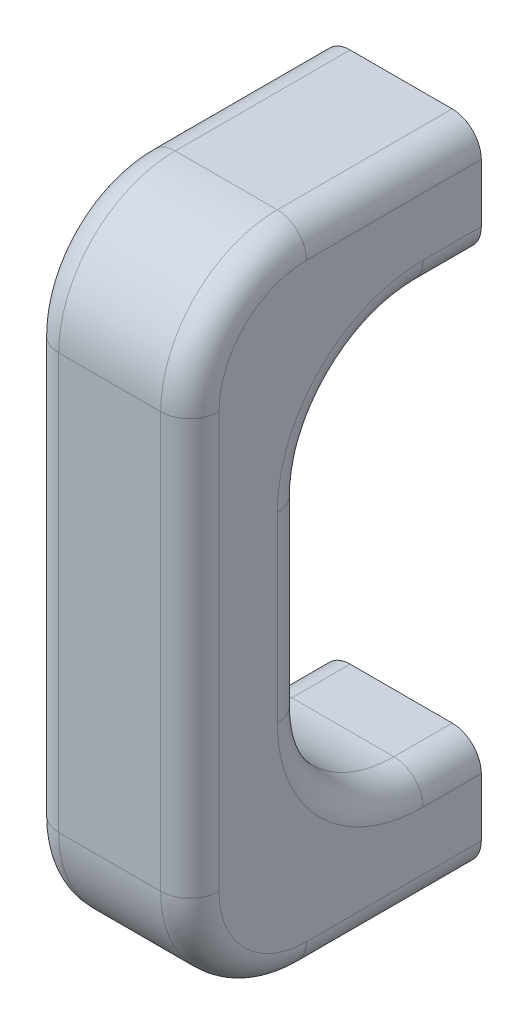
ISO-10303-21;
HEADER;
FILE_DESCRIPTION(('STEP AP214'),'2;1');
FILE_NAME('part.step','',(''),(''),'','','');
FILE_SCHEMA(('AUTOMOTIVE_DESIGN { 1 0 10303 214 1 1 1 1 }'));
ENDSEC;
DATA;
#1=APPLICATION_CONTEXT('core data for automotive mechanical design processes');
#2=APPLICATION_PROTOCOL_DEFINITION('international standard','automotive_design',2000,#1);
#3=PRODUCT_CONTEXT('',#1,'mechanical');
#4=PRODUCT('Part','Part','',(#3));
#5=PRODUCT_RELATED_PRODUCT_CATEGORY('part','',(#4));
#6=PRODUCT_DEFINITION_FORMATION('','',#4);
#7=PRODUCT_DEFINITION_CONTEXT('part definition',#1,'design');
#8=PRODUCT_DEFINITION('design','',#6,#7);
#9=PRODUCT_DEFINITION_SHAPE('','',#8);
#10=(LENGTH_UNIT() NAMED_UNIT(*) SI_UNIT(.MILLI.,.METRE.));
#11=(NAMED_UNIT(*) PLANE_ANGLE_UNIT() SI_UNIT($,.RADIAN.));
#12=(NAMED_UNIT(*) SI_UNIT($,.STERADIAN.) SOLID_ANGLE_UNIT());
#13=UNCERTAINTY_MEASURE_WITH_UNIT(LENGTH_MEASURE(1.E-05),#10,'distance_accuracy_value','');
#14=(GEOMETRIC_REPRESENTATION_CONTEXT(3) GLOBAL_UNCERTAINTY_ASSIGNED_CONTEXT((#13)) GLOBAL_UNIT_ASSIGNED_CONTEXT((#10,
#11,#12)) REPRESENTATION_CONTEXT('',''));
#15=CARTESIAN_POINT('',(0.,0.,0.));
#16=DIRECTION('',(0.,0.,1.));
#17=DIRECTION('',(1.,0.,0.));
#18=AXIS2_PLACEMENT_3D('',#15,#16,#17);
#19=CARTESIAN_POINT('',(0.,0.,0.));
#20=DIRECTION('',(0.,0.,-1.));
#21=DIRECTION('',(-1.,0.,0.));
#22=AXIS2_PLACEMENT_3D('',#19,#20,#21);
#23=PLANE('',#22);
#24=CARTESIAN_POINT('',(0.,-18.2502747095136,0.));
#25=DIRECTION('',(0.,0.,-1.));
#26=DIRECTION('',(-1.,0.,0.));
#27=AXIS2_PLACEMENT_3D('',#24,#25,#26);
#28=CIRCLE('',#27,1.5);
#29=CARTESIAN_POINT('',(-1.5,-18.2502747095136,0.));
#30=VERTEX_POINT('',#29);
#31=EDGE_CURVE('E403',#30,#30,#28,.T.);
#32=ORIENTED_EDGE('',*,*,#31,.F.);
#33=EDGE_LOOP('',(#32));
#34=FACE_BOUND('',#33,.T.);
#35=DIRECTION('',(-1.,0.,0.));
#36=VECTOR('',#35,1.);
#37=CARTESIAN_POINT('',(0.,-14.2505494190273,0.));
#38=LINE('',#37,#36);
#39=CARTESIAN_POINT('',(3.5,-14.2505494190273,0.));
#40=VERTEX_POINT('',#39);
#41=CARTESIAN_POINT('',(-3.5,-14.2505494190273,0.));
#42=VERTEX_POINT('',#41);
#43=EDGE_CURVE('E256',#40,#42,#38,.T.);
#44=ORIENTED_EDGE('',*,*,#43,.F.);
#45=CARTESIAN_POINT('',(3.5,-16.2505494190273,0.));
#46=DIRECTION('',(0.,0.,-1.));
#47=DIRECTION('',(-1.,0.,0.));
#48=AXIS2_PLACEMENT_3D('',#45,#46,#47);
#49=CIRCLE('',#48,2.);
#50=CARTESIAN_POINT('',(5.5,-16.2505494190273,0.));
#51=VERTEX_POINT('',#50);
#52=EDGE_CURVE('E519',#40,#51,#49,.T.);
#53=ORIENTED_EDGE('',*,*,#52,.T.);
#54=DIRECTION('',(0.,1.,0.));
#55=VECTOR('',#54,1.);
#56=CARTESIAN_POINT('',(5.5,-22.25,0.));
#57=LINE('',#56,#55);
#58=CARTESIAN_POINT('',(5.5,-20.25,0.));
#59=VERTEX_POINT('',#58);
#60=EDGE_CURVE('E602',#59,#51,#57,.T.);
#61=ORIENTED_EDGE('',*,*,#60,.F.);
#62=CARTESIAN_POINT('',(3.5,-20.25,0.));
#63=DIRECTION('',(0.,0.,-1.));
#64=DIRECTION('',(-1.,0.,0.));
#65=AXIS2_PLACEMENT_3D('',#62,#63,#64);
#66=CIRCLE('',#65,2.);
#67=CARTESIAN_POINT('',(3.5,-22.25,0.));
#68=VERTEX_POINT('',#67);
#69=EDGE_CURVE('E513',#59,#68,#66,.T.);
#70=ORIENTED_EDGE('',*,*,#69,.T.);
#71=DIRECTION('',(1.,0.,0.));
#72=VECTOR('',#71,1.);
#73=CARTESIAN_POINT('',(-5.5,-22.25,0.));
#74=LINE('',#73,#72);
#75=CARTESIAN_POINT('',(-3.5,-22.25,0.));
#76=VERTEX_POINT('',#75);
#77=EDGE_CURVE('E468',#76,#68,#74,.T.);
#78=ORIENTED_EDGE('',*,*,#77,.F.);
#79=CARTESIAN_POINT('',(-3.5,-20.25,0.));
#80=DIRECTION('',(0.,0.,-1.));
#81=DIRECTION('',(-1.,0.,0.));
#82=AXIS2_PLACEMENT_3D('',#79,#80,#81);
#83=CIRCLE('',#82,2.);
#84=CARTESIAN_POINT('',(-5.5,-20.25,0.));
#85=VERTEX_POINT('',#84);
#86=EDGE_CURVE('E510',#76,#85,#83,.T.);
#87=ORIENTED_EDGE('',*,*,#86,.T.);
#88=DIRECTION('',(0.,-1.,0.));
#89=VECTOR('',#88,1.);
#90=CARTESIAN_POINT('',(-5.5,-22.25,0.));
#91=LINE('',#90,#89);
#92=CARTESIAN_POINT('',(-5.5,-16.2505494190273,0.));
#93=VERTEX_POINT('',#92);
#94=EDGE_CURVE('E469',#93,#85,#91,.T.);
#95=ORIENTED_EDGE('',*,*,#94,.F.);
#96=CARTESIAN_POINT('',(-3.5,-16.2505494190273,0.));
#97=DIRECTION('',(0.,0.,-1.));
#98=DIRECTION('',(-1.,0.,0.));
#99=AXIS2_PLACEMENT_3D('',#96,#97,#98);
#100=CIRCLE('',#99,2.);
#101=EDGE_CURVE('E516',#93,#42,#100,.T.);
#102=ORIENTED_EDGE('',*,*,#101,.T.);
#103=EDGE_LOOP('',(#44,#53,#61,#70,#78,#87,#95,#102));
#104=FACE_BOUND('',#103,.T.);
#105=ADVANCED_FACE('F38',(#34,#104),#23,.T.);
#106=CARTESIAN_POINT('',(5.5,-22.25,20.));
#107=DIRECTION('',(-1.,0.,0.));
#108=DIRECTION('',(0.,0.,1.));
#109=AXIS2_PLACEMENT_3D('',#106,#107,#108);
#110=PLANE('',#109);
#111=ORIENTED_EDGE('',*,*,#60,.T.);
#112=DIRECTION('',(0.,0.,-1.));
#113=VECTOR('',#112,1.);
#114=CARTESIAN_POINT('',(5.5,-16.2505494190273,20.));
#115=LINE('',#114,#113);
#116=CARTESIAN_POINT('',(5.5,-16.2505494190273,3.99985580356592));
#117=VERTEX_POINT('',#116);
#118=EDGE_CURVE('E291',#51,#117,#115,.F.);
#119=ORIENTED_EDGE('',*,*,#118,.T.);
#120=CARTESIAN_POINT('',(5.5,-6.25054941902726,3.99985580356592));
#121=DIRECTION('',(-1.,0.,0.));
#122=DIRECTION('',(0.,0.,1.));
#123=AXIS2_PLACEMENT_3D('',#120,#121,#122);
#124=CIRCLE('',#123,10.);
#125=CARTESIAN_POINT('',(5.5,-6.25054941902726,13.9998558035659));
#126=VERTEX_POINT('',#125);
#127=EDGE_CURVE('E298',#117,#126,#124,.T.);
#128=ORIENTED_EDGE('',*,*,#127,.T.);
#129=DIRECTION('',(0.,-1.,0.));
#130=VECTOR('',#129,1.);
#131=CARTESIAN_POINT('',(5.5,-22.25,13.9998558035659));
#132=LINE('',#131,#130);
#133=CARTESIAN_POINT('',(5.5,6.25054941902726,13.9998558035659));
#134=VERTEX_POINT('',#133);
#135=EDGE_CURVE('E542',#126,#134,#132,.F.);
#136=ORIENTED_EDGE('',*,*,#135,.T.);
#137=CARTESIAN_POINT('',(5.5,6.25054941902726,3.99985580356592));
#138=DIRECTION('',(-1.,0.,0.));
#139=DIRECTION('',(0.,0.,1.));
#140=AXIS2_PLACEMENT_3D('',#137,#138,#139);
#141=CIRCLE('',#140,10.);
#142=CARTESIAN_POINT('',(5.5,16.2505494190273,3.99985580356592));
#143=VERTEX_POINT('',#142);
#144=EDGE_CURVE('E536',#134,#143,#141,.T.);
#145=ORIENTED_EDGE('',*,*,#144,.T.);
#146=DIRECTION('',(0.,0.,1.));
#147=VECTOR('',#146,1.);
#148=CARTESIAN_POINT('',(5.5,16.2505494190273,20.));
#149=LINE('',#148,#147);
#150=CARTESIAN_POINT('',(5.5,16.2505494190273,0.));
#151=VERTEX_POINT('',#150);
#152=EDGE_CURVE('E539',#143,#151,#149,.F.);
#153=ORIENTED_EDGE('',*,*,#152,.T.);
#154=CARTESIAN_POINT('',(5.5,20.25,0.));
#155=VERTEX_POINT('',#154);
#156=EDGE_CURVE('E604',#151,#155,#57,.T.);
#157=ORIENTED_EDGE('',*,*,#156,.T.);
#158=DIRECTION('',(0.,0.,-1.));
#159=VECTOR('',#158,1.);
#160=CARTESIAN_POINT('',(5.5,20.25,20.));
#161=LINE('',#160,#159);
#162=CARTESIAN_POINT('',(5.5,20.25,12.));
#163=VERTEX_POINT('',#162);
#164=EDGE_CURVE('E533',#155,#163,#161,.F.);
#165=ORIENTED_EDGE('',*,*,#164,.T.);
#166=CARTESIAN_POINT('',(5.5,14.25,12.));
#167=DIRECTION('',(-1.,0.,0.));
#168=DIRECTION('',(0.,0.,1.));
#169=AXIS2_PLACEMENT_3D('',#166,#167,#168);
#170=CIRCLE('',#169,6.);
#171=CARTESIAN_POINT('',(5.5,14.25,18.));
#172=VERTEX_POINT('',#171);
#173=EDGE_CURVE('E522',#163,#172,#170,.F.);
#174=ORIENTED_EDGE('',*,*,#173,.T.);
#175=DIRECTION('',(0.,1.,0.));
#176=VECTOR('',#175,1.);
#177=CARTESIAN_POINT('',(5.5,-22.25,18.));
#178=LINE('',#177,#176);
#179=CARTESIAN_POINT('',(5.5,-14.25,18.));
#180=VERTEX_POINT('',#179);
#181=EDGE_CURVE('E524',#172,#180,#178,.F.);
#182=ORIENTED_EDGE('',*,*,#181,.T.);
#183=CARTESIAN_POINT('',(5.5,-14.25,12.));
#184=DIRECTION('',(-1.,0.,0.));
#185=DIRECTION('',(0.,0.,1.));
#186=AXIS2_PLACEMENT_3D('',#183,#184,#185);
#187=CIRCLE('',#186,6.);
#188=CARTESIAN_POINT('',(5.5,-20.25,12.));
#189=VERTEX_POINT('',#188);
#190=EDGE_CURVE('E527',#180,#189,#187,.F.);
#191=ORIENTED_EDGE('',*,*,#190,.T.);
#192=DIRECTION('',(0.,0.,-1.));
#193=VECTOR('',#192,1.);
#194=CARTESIAN_POINT('',(5.5,-20.25,20.));
#195=LINE('',#194,#193);
#196=EDGE_CURVE('E530',#189,#59,#195,.T.);
#197=ORIENTED_EDGE('',*,*,#196,.T.);
#198=EDGE_LOOP('',(#111,#119,#128,#136,#145,#153,#157,#165,#174,#182,#191,#197));
#199=FACE_BOUND('',#198,.T.);
#200=ADVANCED_FACE('F549',(#199),#110,.F.);
#201=CARTESIAN_POINT('',(-5.5,22.25,20.));
#202=DIRECTION('',(0.,-1.,0.));
#203=DIRECTION('',(0.,0.,-1.));
#204=AXIS2_PLACEMENT_3D('',#201,#202,#203);
#205=PLANE('',#204);
#206=DIRECTION('',(-1.,0.,0.));
#207=VECTOR('',#206,1.);
#208=CARTESIAN_POINT('',(-5.5,22.25,12.));
#209=LINE('',#208,#207);
#210=CARTESIAN_POINT('',(-3.5,22.25,12.));
#211=VERTEX_POINT('',#210);
#212=CARTESIAN_POINT('',(3.5,22.25,12.));
#213=VERTEX_POINT('',#212);
#214=EDGE_CURVE('E490',#211,#213,#209,.F.);
#215=ORIENTED_EDGE('',*,*,#214,.T.);
#216=DIRECTION('',(0.,0.,-1.));
#217=VECTOR('',#216,1.);
#218=CARTESIAN_POINT('',(3.5,22.25,20.));
#219=LINE('',#218,#217);
#220=CARTESIAN_POINT('',(3.5,22.25,0.));
#221=VERTEX_POINT('',#220);
#222=EDGE_CURVE('E358',#213,#221,#219,.T.);
#223=ORIENTED_EDGE('',*,*,#222,.T.);
#224=DIRECTION('',(-1.,0.,0.));
#225=VECTOR('',#224,1.);
#226=CARTESIAN_POINT('',(-5.5,22.25,0.));
#227=LINE('',#226,#225);
#228=CARTESIAN_POINT('',(-3.5,22.25,0.));
#229=VERTEX_POINT('',#228);
#230=EDGE_CURVE('E477',#221,#229,#227,.T.);
#231=ORIENTED_EDGE('',*,*,#230,.T.);
#232=DIRECTION('',(0.,0.,-1.));
#233=VECTOR('',#232,1.);
#234=CARTESIAN_POINT('',(-3.5,22.25,20.));
#235=LINE('',#234,#233);
#236=EDGE_CURVE('E355',#229,#211,#235,.F.);
#237=ORIENTED_EDGE('',*,*,#236,.T.);
#238=EDGE_LOOP('',(#215,#223,#231,#237));
#239=FACE_BOUND('',#238,.T.);
#240=ADVANCED_FACE('F600',(#239),#205,.F.);
#241=CARTESIAN_POINT('',(-5.5,-22.25,20.));
#242=DIRECTION('',(1.,0.,0.));
#243=DIRECTION('',(0.,0.,-1.));
#244=AXIS2_PLACEMENT_3D('',#241,#242,#243);
#245=PLANE('',#244);
#246=CARTESIAN_POINT('',(-5.5,20.25,0.));
#247=VERTEX_POINT('',#246);
#248=CARTESIAN_POINT('',(-5.5,16.2505494190273,0.));
#249=VERTEX_POINT('',#248);
#250=EDGE_CURVE('E458',#247,#249,#91,.T.);
#251=ORIENTED_EDGE('',*,*,#250,.T.);
#252=DIRECTION('',(0.,0.,1.));
#253=VECTOR('',#252,1.);
#254=CARTESIAN_POINT('',(-5.5,16.2505494190273,20.));
#255=LINE('',#254,#253);
#256=CARTESIAN_POINT('',(-5.5,16.2505494190273,3.99985580356592));
#257=VERTEX_POINT('',#256);
#258=EDGE_CURVE('E351',#249,#257,#255,.T.);
#259=ORIENTED_EDGE('',*,*,#258,.T.);
#260=CARTESIAN_POINT('',(-5.5,6.25054941902726,3.99985580356592));
#261=DIRECTION('',(1.,0.,0.));
#262=DIRECTION('',(0.,0.,-1.));
#263=AXIS2_PLACEMENT_3D('',#260,#261,#262);
#264=CIRCLE('',#263,10.);
#265=CARTESIAN_POINT('',(-5.5,6.25054941902726,13.9998558035659));
#266=VERTEX_POINT('',#265);
#267=EDGE_CURVE('E340',#257,#266,#264,.T.);
#268=ORIENTED_EDGE('',*,*,#267,.T.);
#269=DIRECTION('',(0.,-1.,0.));
#270=VECTOR('',#269,1.);
#271=CARTESIAN_POINT('',(-5.5,-22.25,13.9998558035659));
#272=LINE('',#271,#270);
#273=CARTESIAN_POINT('',(-5.5,-6.25054941902726,13.9998558035659));
#274=VERTEX_POINT('',#273);
#275=EDGE_CURVE('E343',#266,#274,#272,.T.);
#276=ORIENTED_EDGE('',*,*,#275,.T.);
#277=CARTESIAN_POINT('',(-5.5,-6.25054941902726,3.99985580356592));
#278=DIRECTION('',(1.,0.,0.));
#279=DIRECTION('',(0.,0.,-1.));
#280=AXIS2_PLACEMENT_3D('',#277,#278,#279);
#281=CIRCLE('',#280,10.);
#282=CARTESIAN_POINT('',(-5.5,-16.2505494190273,3.99985580356592));
#283=VERTEX_POINT('',#282);
#284=EDGE_CURVE('E346',#274,#283,#281,.T.);
#285=ORIENTED_EDGE('',*,*,#284,.T.);
#286=DIRECTION('',(0.,0.,-1.));
#287=VECTOR('',#286,1.);
#288=CARTESIAN_POINT('',(-5.5,-16.2505494190273,20.));
#289=LINE('',#288,#287);
#290=EDGE_CURVE('E279',#283,#93,#289,.T.);
#291=ORIENTED_EDGE('',*,*,#290,.T.);
#292=ORIENTED_EDGE('',*,*,#94,.T.);
#293=DIRECTION('',(0.,0.,-1.));
#294=VECTOR('',#293,1.);
#295=CARTESIAN_POINT('',(-5.5,-20.25,20.));
#296=LINE('',#295,#294);
#297=CARTESIAN_POINT('',(-5.5,-20.25,12.));
#298=VERTEX_POINT('',#297);
#299=EDGE_CURVE('E337',#85,#298,#296,.F.);
#300=ORIENTED_EDGE('',*,*,#299,.T.);
#301=CARTESIAN_POINT('',(-5.5,-14.25,12.));
#302=DIRECTION('',(1.,0.,0.));
#303=DIRECTION('',(0.,0.,-1.));
#304=AXIS2_PLACEMENT_3D('',#301,#302,#303);
#305=CIRCLE('',#304,6.);
#306=CARTESIAN_POINT('',(-5.5,-14.25,18.));
#307=VERTEX_POINT('',#306);
#308=EDGE_CURVE('E334',#298,#307,#305,.F.);
#309=ORIENTED_EDGE('',*,*,#308,.T.);
#310=DIRECTION('',(0.,-1.,0.));
#311=VECTOR('',#310,1.);
#312=CARTESIAN_POINT('',(-5.5,-22.25,18.));
#313=LINE('',#312,#311);
#314=CARTESIAN_POINT('',(-5.5,14.25,18.));
#315=VERTEX_POINT('',#314);
#316=EDGE_CURVE('E331',#307,#315,#313,.F.);
#317=ORIENTED_EDGE('',*,*,#316,.T.);
#318=CARTESIAN_POINT('',(-5.5,14.25,12.));
#319=DIRECTION('',(1.,0.,0.));
#320=DIRECTION('',(0.,0.,-1.));
#321=AXIS2_PLACEMENT_3D('',#318,#319,#320);
#322=CIRCLE('',#321,6.);
#323=CARTESIAN_POINT('',(-5.5,20.25,12.));
#324=VERTEX_POINT('',#323);
#325=EDGE_CURVE('E325',#315,#324,#322,.F.);
#326=ORIENTED_EDGE('',*,*,#325,.T.);
#327=DIRECTION('',(0.,0.,-1.));
#328=VECTOR('',#327,1.);
#329=CARTESIAN_POINT('',(-5.5,20.25,20.));
#330=LINE('',#329,#328);
#331=EDGE_CURVE('E328',#324,#247,#330,.T.);
#332=ORIENTED_EDGE('',*,*,#331,.T.);
#333=EDGE_LOOP('',(#251,#259,#268,#276,#285,#291,#292,#300,#309,#317,#326,#332));
#334=FACE_BOUND('',#333,.T.);
#335=ADVANCED_FACE('F457',(#334),#245,.F.);
#336=CARTESIAN_POINT('',(-5.5,-22.25,20.));
#337=DIRECTION('',(0.,1.,0.));
#338=DIRECTION('',(0.,0.,1.));
#339=AXIS2_PLACEMENT_3D('',#336,#337,#338);
#340=PLANE('',#339);
#341=ORIENTED_EDGE('',*,*,#77,.T.);
#342=DIRECTION('',(0.,0.,-1.));
#343=VECTOR('',#342,1.);
#344=CARTESIAN_POINT('',(3.5,-22.25,20.));
#345=LINE('',#344,#343);
#346=CARTESIAN_POINT('',(3.5,-22.25,12.));
#347=VERTEX_POINT('',#346);
#348=EDGE_CURVE('E366',#68,#347,#345,.F.);
#349=ORIENTED_EDGE('',*,*,#348,.T.);
#350=DIRECTION('',(1.,0.,0.));
#351=VECTOR('',#350,1.);
#352=CARTESIAN_POINT('',(-5.5,-22.25,12.));
#353=LINE('',#352,#351);
#354=CARTESIAN_POINT('',(-3.5,-22.25,12.));
#355=VERTEX_POINT('',#354);
#356=EDGE_CURVE('E486',#347,#355,#353,.F.);
#357=ORIENTED_EDGE('',*,*,#356,.T.);
#358=DIRECTION('',(0.,0.,-1.));
#359=VECTOR('',#358,1.);
#360=CARTESIAN_POINT('',(-3.5,-22.25,20.));
#361=LINE('',#360,#359);
#362=EDGE_CURVE('E362',#355,#76,#361,.T.);
#363=ORIENTED_EDGE('',*,*,#362,.T.);
#364=EDGE_LOOP('',(#341,#349,#357,#363));
#365=FACE_BOUND('',#364,.T.);
#366=ADVANCED_FACE('F639',(#365),#340,.F.);
#367=CARTESIAN_POINT('',(0.,0.,20.));
#368=DIRECTION('',(0.,0.,-1.));
#369=DIRECTION('',(-1.,0.,0.));
#370=AXIS2_PLACEMENT_3D('',#367,#368,#369);
#371=PLANE('',#370);
#372=DIRECTION('',(1.,0.,0.));
#373=VECTOR('',#372,1.);
#374=CARTESIAN_POINT('',(0.,-14.25,20.));
#375=LINE('',#374,#373);
#376=CARTESIAN_POINT('',(-3.5,-14.25,20.));
#377=VERTEX_POINT('',#376);
#378=CARTESIAN_POINT('',(3.5,-14.25,20.));
#379=VERTEX_POINT('',#378);
#380=EDGE_CURVE('E483',#377,#379,#375,.T.);
#381=ORIENTED_EDGE('',*,*,#380,.T.);
#382=DIRECTION('',(0.,1.,0.));
#383=VECTOR('',#382,1.);
#384=CARTESIAN_POINT('',(3.5,0.,20.));
#385=LINE('',#384,#383);
#386=CARTESIAN_POINT('',(3.5,14.25,20.));
#387=VERTEX_POINT('',#386);
#388=EDGE_CURVE('E67',#379,#387,#385,.T.);
#389=ORIENTED_EDGE('',*,*,#388,.T.);
#390=DIRECTION('',(-1.,0.,0.));
#391=VECTOR('',#390,1.);
#392=CARTESIAN_POINT('',(0.,14.25,20.));
#393=LINE('',#392,#391);
#394=CARTESIAN_POINT('',(-3.5,14.25,20.));
#395=VERTEX_POINT('',#394);
#396=EDGE_CURVE('E473',#387,#395,#393,.T.);
#397=ORIENTED_EDGE('',*,*,#396,.T.);
#398=DIRECTION('',(0.,-1.,0.));
#399=VECTOR('',#398,1.);
#400=CARTESIAN_POINT('',(-3.5,0.,20.));
#401=LINE('',#400,#399);
#402=EDGE_CURVE('E375',#395,#377,#401,.T.);
#403=ORIENTED_EDGE('',*,*,#402,.T.);
#404=EDGE_LOOP('',(#381,#389,#397,#403));
#405=FACE_BOUND('',#404,.T.);
#406=ADVANCED_FACE('F578',(#405),#371,.F.);
#407=CARTESIAN_POINT('',(0.,18.2502747095136,0.));
#408=DIRECTION('',(0.,0.,-1.));
#409=DIRECTION('',(-1.,0.,0.));
#410=AXIS2_PLACEMENT_3D('',#407,#408,#409);
#411=CIRCLE('',#410,1.5);
#412=CARTESIAN_POINT('',(-1.5,18.2502747095136,0.));
#413=VERTEX_POINT('',#412);
#414=EDGE_CURVE('E615',#413,#413,#411,.T.);
#415=ORIENTED_EDGE('',*,*,#414,.F.);
#416=EDGE_LOOP('',(#415));
#417=FACE_BOUND('',#416,.T.);
#418=ORIENTED_EDGE('',*,*,#156,.F.);
#419=CARTESIAN_POINT('',(3.5,16.2505494190273,0.));
#420=DIRECTION('',(0.,0.,-1.));
#421=DIRECTION('',(-1.,0.,0.));
#422=AXIS2_PLACEMENT_3D('',#419,#420,#421);
#423=CIRCLE('',#422,2.);
#424=CARTESIAN_POINT('',(3.5,14.2505494190273,0.));
#425=VERTEX_POINT('',#424);
#426=EDGE_CURVE('E322',#151,#425,#423,.T.);
#427=ORIENTED_EDGE('',*,*,#426,.T.);
#428=DIRECTION('',(1.,0.,0.));
#429=VECTOR('',#428,1.);
#430=CARTESIAN_POINT('',(0.,14.2505494190273,0.));
#431=LINE('',#430,#429);
#432=CARTESIAN_POINT('',(-3.5,14.2505494190273,0.));
#433=VERTEX_POINT('',#432);
#434=EDGE_CURVE('E493',#433,#425,#431,.T.);
#435=ORIENTED_EDGE('',*,*,#434,.F.);
#436=CARTESIAN_POINT('',(-3.5,16.2505494190273,0.));
#437=DIRECTION('',(0.,0.,-1.));
#438=DIRECTION('',(-1.,0.,0.));
#439=AXIS2_PLACEMENT_3D('',#436,#437,#438);
#440=CIRCLE('',#439,2.);
#441=EDGE_CURVE('E319',#433,#249,#440,.T.);
#442=ORIENTED_EDGE('',*,*,#441,.T.);
#443=ORIENTED_EDGE('',*,*,#250,.F.);
#444=CARTESIAN_POINT('',(-3.5,20.25,0.));
#445=DIRECTION('',(0.,0.,-1.));
#446=DIRECTION('',(-1.,0.,0.));
#447=AXIS2_PLACEMENT_3D('',#444,#445,#446);
#448=CIRCLE('',#447,2.);
#449=EDGE_CURVE('E313',#247,#229,#448,.T.);
#450=ORIENTED_EDGE('',*,*,#449,.T.);
#451=ORIENTED_EDGE('',*,*,#230,.F.);
#452=CARTESIAN_POINT('',(3.5,20.25,0.));
#453=DIRECTION('',(0.,0.,-1.));
#454=DIRECTION('',(-1.,0.,0.));
#455=AXIS2_PLACEMENT_3D('',#452,#453,#454);
#456=CIRCLE('',#455,2.);
#457=EDGE_CURVE('E316',#221,#155,#456,.T.);
#458=ORIENTED_EDGE('',*,*,#457,.T.);
#459=EDGE_LOOP('',(#418,#427,#435,#442,#443,#450,#451,#458));
#460=FACE_BOUND('',#459,.T.);
#461=ADVANCED_FACE('F462',(#417,#460),#23,.T.);
#462=CARTESIAN_POINT('',(0.,-14.25,12.));
#463=DIRECTION('',(1.,0.,0.));
#464=DIRECTION('',(0.,0.,-1.));
#465=AXIS2_PLACEMENT_3D('',#462,#463,#464);
#466=CYLINDRICAL_SURFACE('',#465,8.);
#467=ORIENTED_EDGE('',*,*,#356,.F.);
#468=CARTESIAN_POINT('',(3.5,-14.25,12.));
#469=DIRECTION('',(-1.,0.,0.));
#470=DIRECTION('',(0.,0.,1.));
#471=AXIS2_PLACEMENT_3D('',#468,#469,#470);
#472=CIRCLE('',#471,8.);
#473=EDGE_CURVE('E372',#347,#379,#472,.T.);
#474=ORIENTED_EDGE('',*,*,#473,.T.);
#475=ORIENTED_EDGE('',*,*,#380,.F.);
#476=CARTESIAN_POINT('',(-3.5,-14.25,12.));
#477=DIRECTION('',(1.,0.,0.));
#478=DIRECTION('',(0.,0.,-1.));
#479=AXIS2_PLACEMENT_3D('',#476,#477,#478);
#480=CIRCLE('',#479,8.);
#481=EDGE_CURVE('E369',#377,#355,#480,.T.);
#482=ORIENTED_EDGE('',*,*,#481,.T.);
#483=EDGE_LOOP('',(#467,#474,#475,#482));
#484=FACE_BOUND('',#483,.T.);
#485=ADVANCED_FACE('F582',(#484),#466,.T.);
#486=CARTESIAN_POINT('',(0.,14.25,12.));
#487=DIRECTION('',(-1.,0.,0.));
#488=DIRECTION('',(0.,0.,1.));
#489=AXIS2_PLACEMENT_3D('',#486,#487,#488);
#490=CYLINDRICAL_SURFACE('',#489,8.);
#491=ORIENTED_EDGE('',*,*,#396,.F.);
#492=CARTESIAN_POINT('',(3.5,14.25,12.));
#493=DIRECTION('',(-1.,0.,0.));
#494=DIRECTION('',(0.,0.,1.));
#495=AXIS2_PLACEMENT_3D('',#492,#493,#494);
#496=CIRCLE('',#495,8.);
#497=EDGE_CURVE('E11',#387,#213,#496,.T.);
#498=ORIENTED_EDGE('',*,*,#497,.T.);
#499=ORIENTED_EDGE('',*,*,#214,.F.);
#500=CARTESIAN_POINT('',(-3.5,14.25,12.));
#501=DIRECTION('',(1.,0.,0.));
#502=DIRECTION('',(0.,0.,-1.));
#503=AXIS2_PLACEMENT_3D('',#500,#501,#502);
#504=CIRCLE('',#503,8.);
#505=EDGE_CURVE('E48',#211,#395,#504,.T.);
#506=ORIENTED_EDGE('',*,*,#505,.T.);
#507=EDGE_LOOP('',(#491,#498,#499,#506));
#508=FACE_BOUND('',#507,.T.);
#509=ADVANCED_FACE('F598',(#508),#490,.T.);
#510=CARTESIAN_POINT('',(-14.5,14.2505494190273,11.9998558035659));
#511=DIRECTION('',(0.,0.,1.));
#512=DIRECTION('',(1.,0.,0.));
#513=AXIS2_PLACEMENT_3D('',#510,#511,#512);
#514=PLANE('',#513);
#515=DIRECTION('',(1.,0.,0.));
#516=VECTOR('',#515,1.);
#517=CARTESIAN_POINT('',(5.5,6.25054941902726,11.9998558035659));
#518=LINE('',#517,#516);
#519=CARTESIAN_POINT('',(-3.5,6.25054941902726,11.9998558035659));
#520=VERTEX_POINT('',#519);
#521=CARTESIAN_POINT('',(3.5,6.25054941902726,11.9998558035659));
#522=VERTEX_POINT('',#521);
#523=EDGE_CURVE('E273',#520,#522,#518,.T.);
#524=ORIENTED_EDGE('',*,*,#523,.T.);
#525=DIRECTION('',(0.,-1.,0.));
#526=VECTOR('',#525,1.);
#527=CARTESIAN_POINT('',(3.5,14.2505494190273,11.9998558035659));
#528=LINE('',#527,#526);
#529=CARTESIAN_POINT('',(3.5,-6.25054941902726,11.9998558035659));
#530=VERTEX_POINT('',#529);
#531=EDGE_CURVE('E304',#522,#530,#528,.T.);
#532=ORIENTED_EDGE('',*,*,#531,.T.);
#533=DIRECTION('',(1.,0.,0.));
#534=VECTOR('',#533,1.);
#535=CARTESIAN_POINT('',(-5.5,-6.25054941902726,11.9998558035659));
#536=LINE('',#535,#534);
#537=CARTESIAN_POINT('',(-3.5,-6.25054941902726,11.9998558035659));
#538=VERTEX_POINT('',#537);
#539=EDGE_CURVE('E502',#530,#538,#536,.F.);
#540=ORIENTED_EDGE('',*,*,#539,.T.);
#541=DIRECTION('',(0.,-1.,0.));
#542=VECTOR('',#541,1.);
#543=CARTESIAN_POINT('',(-3.5,14.2505494190273,11.9998558035659));
#544=LINE('',#543,#542);
#545=EDGE_CURVE('E295',#538,#520,#544,.F.);
#546=ORIENTED_EDGE('',*,*,#545,.T.);
#547=EDGE_LOOP('',(#524,#532,#540,#546));
#548=FACE_BOUND('',#547,.T.);
#549=ADVANCED_FACE('F668',(#548),#514,.F.);
#550=CARTESIAN_POINT('',(-14.5,-14.2505494190273,11.9998558035659));
#551=DIRECTION('',(0.,-1.,0.));
#552=DIRECTION('',(0.,0.,-1.));
#553=AXIS2_PLACEMENT_3D('',#550,#551,#552);
#554=PLANE('',#553);
#555=DIRECTION('',(1.,0.,0.));
#556=VECTOR('',#555,1.);
#557=CARTESIAN_POINT('',(5.5,-14.2505494190273,3.99985580356592));
#558=LINE('',#557,#556);
#559=CARTESIAN_POINT('',(-3.5,-14.2505494190273,3.99985580356592));
#560=VERTEX_POINT('',#559);
#561=CARTESIAN_POINT('',(3.5,-14.2505494190273,3.99985580356592));
#562=VERTEX_POINT('',#561);
#563=EDGE_CURVE('E253',#560,#562,#558,.T.);
#564=ORIENTED_EDGE('',*,*,#563,.T.);
#565=DIRECTION('',(0.,0.,-1.));
#566=VECTOR('',#565,1.);
#567=CARTESIAN_POINT('',(3.5,-14.2505494190273,11.9998558035659));
#568=LINE('',#567,#566);
#569=EDGE_CURVE('E261',#562,#40,#568,.T.);
#570=ORIENTED_EDGE('',*,*,#569,.T.);
#571=ORIENTED_EDGE('',*,*,#43,.T.);
#572=DIRECTION('',(0.,0.,-1.));
#573=VECTOR('',#572,1.);
#574=CARTESIAN_POINT('',(-3.5,-14.2505494190273,11.9998558035659));
#575=LINE('',#574,#573);
#576=EDGE_CURVE('E249',#42,#560,#575,.F.);
#577=ORIENTED_EDGE('',*,*,#576,.T.);
#578=EDGE_LOOP('',(#564,#570,#571,#577));
#579=FACE_BOUND('',#578,.T.);
#580=ADVANCED_FACE('F251',(#579),#554,.F.);
#581=CARTESIAN_POINT('',(-14.5,14.2505494190273,11.9998558035659));
#582=DIRECTION('',(0.,1.,0.));
#583=DIRECTION('',(0.,0.,1.));
#584=AXIS2_PLACEMENT_3D('',#581,#582,#583);
#585=PLANE('',#584);
#586=ORIENTED_EDGE('',*,*,#434,.T.);
#587=DIRECTION('',(0.,0.,1.));
#588=VECTOR('',#587,1.);
#589=CARTESIAN_POINT('',(3.5,14.2505494190273,11.9998558035659));
#590=LINE('',#589,#588);
#591=CARTESIAN_POINT('',(3.5,14.2505494190273,3.99985580356592));
#592=VERTEX_POINT('',#591);
#593=EDGE_CURVE('E310',#425,#592,#590,.T.);
#594=ORIENTED_EDGE('',*,*,#593,.T.);
#595=DIRECTION('',(1.,0.,0.));
#596=VECTOR('',#595,1.);
#597=CARTESIAN_POINT('',(-5.5,14.2505494190273,3.99985580356592));
#598=LINE('',#597,#596);
#599=CARTESIAN_POINT('',(-3.5,14.2505494190273,3.99985580356592));
#600=VERTEX_POINT('',#599);
#601=EDGE_CURVE('E262',#592,#600,#598,.F.);
#602=ORIENTED_EDGE('',*,*,#601,.T.);
#603=DIRECTION('',(0.,0.,1.));
#604=VECTOR('',#603,1.);
#605=CARTESIAN_POINT('',(-3.5,14.2505494190273,11.9998558035659));
#606=LINE('',#605,#604);
#607=EDGE_CURVE('E307',#600,#433,#606,.F.);
#608=ORIENTED_EDGE('',*,*,#607,.T.);
#609=EDGE_LOOP('',(#586,#594,#602,#608));
#610=FACE_BOUND('',#609,.T.);
#611=ADVANCED_FACE('F667',(#610),#585,.F.);
#612=CARTESIAN_POINT('',(-14.5,-6.25054941902726,3.99985580356592));
#613=DIRECTION('',(-1.,0.,0.));
#614=DIRECTION('',(0.,0.,1.));
#615=AXIS2_PLACEMENT_3D('',#612,#613,#614);
#616=CYLINDRICAL_SURFACE('',#615,8.);
#617=ORIENTED_EDGE('',*,*,#539,.F.);
#618=CARTESIAN_POINT('',(3.5,-6.25054941902726,3.99985580356592));
#619=DIRECTION('',(-1.,0.,0.));
#620=DIRECTION('',(0.,0.,1.));
#621=AXIS2_PLACEMENT_3D('',#618,#619,#620);
#622=CIRCLE('',#621,8.);
#623=EDGE_CURVE('E271',#530,#562,#622,.F.);
#624=ORIENTED_EDGE('',*,*,#623,.T.);
#625=ORIENTED_EDGE('',*,*,#563,.F.);
#626=CARTESIAN_POINT('',(-3.5,-6.25054941902726,3.99985580356592));
#627=DIRECTION('',(1.,0.,0.));
#628=DIRECTION('',(0.,0.,-1.));
#629=AXIS2_PLACEMENT_3D('',#626,#627,#628);
#630=CIRCLE('',#629,8.);
#631=EDGE_CURVE('E268',#560,#538,#630,.F.);
#632=ORIENTED_EDGE('',*,*,#631,.T.);
#633=EDGE_LOOP('',(#617,#624,#625,#632));
#634=FACE_BOUND('',#633,.T.);
#635=ADVANCED_FACE('F266',(#634),#616,.F.);
#636=CARTESIAN_POINT('',(-14.5,6.25054941902726,3.99985580356592));
#637=DIRECTION('',(-1.,0.,0.));
#638=DIRECTION('',(0.,0.,1.));
#639=AXIS2_PLACEMENT_3D('',#636,#637,#638);
#640=CYLINDRICAL_SURFACE('',#639,8.);
#641=ORIENTED_EDGE('',*,*,#601,.F.);
#642=CARTESIAN_POINT('',(3.5,6.25054941902726,3.99985580356592));
#643=DIRECTION('',(-1.,0.,0.));
#644=DIRECTION('',(0.,0.,1.));
#645=AXIS2_PLACEMENT_3D('',#642,#643,#644);
#646=CIRCLE('',#645,8.);
#647=EDGE_CURVE('E383',#592,#522,#646,.F.);
#648=ORIENTED_EDGE('',*,*,#647,.T.);
#649=ORIENTED_EDGE('',*,*,#523,.F.);
#650=CARTESIAN_POINT('',(-3.5,6.25054941902726,3.99985580356592));
#651=DIRECTION('',(1.,0.,0.));
#652=DIRECTION('',(0.,0.,-1.));
#653=AXIS2_PLACEMENT_3D('',#650,#651,#652);
#654=CIRCLE('',#653,8.);
#655=EDGE_CURVE('E380',#520,#600,#654,.F.);
#656=ORIENTED_EDGE('',*,*,#655,.T.);
#657=EDGE_LOOP('',(#641,#648,#649,#656));
#658=FACE_BOUND('',#657,.T.);
#659=ADVANCED_FACE('F628',(#658),#640,.F.);
#660=CARTESIAN_POINT('',(0.,18.2502747095136,7.));
#661=DIRECTION('',(0.,0.,-1.));
#662=DIRECTION('',(-1.,0.,0.));
#663=AXIS2_PLACEMENT_3D('',#660,#661,#662);
#664=CYLINDRICAL_SURFACE('',#663,1.5);
#665=CARTESIAN_POINT('',(0.,18.2502747095136,7.));
#666=DIRECTION('',(0.,0.,-1.));
#667=DIRECTION('',(-1.,0.,0.));
#668=AXIS2_PLACEMENT_3D('',#665,#666,#667);
#669=CIRCLE('',#668,1.5);
#670=CARTESIAN_POINT('',(-1.5,18.2502747095136,7.));
#671=VERTEX_POINT('',#670);
#672=EDGE_CURVE('E607',#671,#671,#669,.T.);
#673=ORIENTED_EDGE('',*,*,#672,.F.);
#674=EDGE_LOOP('',(#673));
#675=FACE_BOUND('',#674,.T.);
#676=ORIENTED_EDGE('',*,*,#414,.T.);
#677=EDGE_LOOP('',(#676));
#678=FACE_BOUND('',#677,.T.);
#679=ADVANCED_FACE('F625',(#675,#678),#664,.F.);
#680=CARTESIAN_POINT('',(0.,18.2502747095136,7.));
#681=DIRECTION('',(0.,0.,-1.));
#682=DIRECTION('',(-1.,0.,0.));
#683=AXIS2_PLACEMENT_3D('',#680,#681,#682);
#684=PLANE('',#683);
#685=ORIENTED_EDGE('',*,*,#672,.T.);
#686=EDGE_LOOP('',(#685));
#687=FACE_BOUND('',#686,.T.);
#688=ADVANCED_FACE('F623',(#687),#684,.T.);
#689=CARTESIAN_POINT('',(0.,-18.2502747095136,7.));
#690=DIRECTION('',(0.,0.,-1.));
#691=DIRECTION('',(-1.,0.,0.));
#692=AXIS2_PLACEMENT_3D('',#689,#690,#691);
#693=CYLINDRICAL_SURFACE('',#692,1.5);
#694=CARTESIAN_POINT('',(0.,-18.2502747095136,7.));
#695=DIRECTION('',(0.,0.,-1.));
#696=DIRECTION('',(-1.,0.,0.));
#697=AXIS2_PLACEMENT_3D('',#694,#695,#696);
#698=CIRCLE('',#697,1.5);
#699=CARTESIAN_POINT('',(-1.5,-18.2502747095136,7.));
#700=VERTEX_POINT('',#699);
#701=EDGE_CURVE('E611',#700,#700,#698,.T.);
#702=ORIENTED_EDGE('',*,*,#701,.F.);
#703=EDGE_LOOP('',(#702));
#704=FACE_BOUND('',#703,.T.);
#705=ORIENTED_EDGE('',*,*,#31,.T.);
#706=EDGE_LOOP('',(#705));
#707=FACE_BOUND('',#706,.T.);
#708=ADVANCED_FACE('F650',(#704,#707),#693,.F.);
#709=CARTESIAN_POINT('',(0.,-18.2502747095136,7.));
#710=DIRECTION('',(0.,0.,-1.));
#711=DIRECTION('',(-1.,0.,0.));
#712=AXIS2_PLACEMENT_3D('',#709,#710,#711);
#713=PLANE('',#712);
#714=ORIENTED_EDGE('',*,*,#701,.T.);
#715=EDGE_LOOP('',(#714));
#716=FACE_BOUND('',#715,.T.);
#717=ADVANCED_FACE('F652',(#716),#713,.T.);
#718=CARTESIAN_POINT('',(3.5,16.2505494190273,11.9998558035659));
#719=DIRECTION('',(0.,0.,1.));
#720=DIRECTION('',(1.,0.,0.));
#721=AXIS2_PLACEMENT_3D('',#718,#719,#720);
#722=CYLINDRICAL_SURFACE('',#721,2.);
#723=ORIENTED_EDGE('',*,*,#426,.F.);
#724=ORIENTED_EDGE('',*,*,#152,.F.);
#725=CARTESIAN_POINT('',(3.5,16.2505494190273,3.99985580356592));
#726=DIRECTION('',(0.,0.,1.));
#727=DIRECTION('',(1.,0.,0.));
#728=AXIS2_PLACEMENT_3D('',#725,#726,#727);
#729=CIRCLE('',#728,2.);
#730=EDGE_CURVE('E399',#592,#143,#729,.T.);
#731=ORIENTED_EDGE('',*,*,#730,.F.);
#732=ORIENTED_EDGE('',*,*,#593,.F.);
#733=EDGE_LOOP('',(#723,#724,#731,#732));
#734=FACE_BOUND('',#733,.T.);
#735=ADVANCED_FACE('F659',(#734),#722,.T.);
#736=CARTESIAN_POINT('',(3.5,6.25054941902726,3.99985580356592));
#737=DIRECTION('',(-1.,0.,0.));
#738=DIRECTION('',(0.,0.,1.));
#739=AXIS2_PLACEMENT_3D('',#736,#737,#738);
#740=TOROIDAL_SURFACE('',#739,10.,2.);
#741=ORIENTED_EDGE('',*,*,#730,.T.);
#742=ORIENTED_EDGE('',*,*,#144,.F.);
#743=CARTESIAN_POINT('',(3.5,6.25054941902726,13.9998558035659));
#744=DIRECTION('',(0.,-1.,0.));
#745=DIRECTION('',(0.,0.,-1.));
#746=AXIS2_PLACEMENT_3D('',#743,#744,#745);
#747=CIRCLE('',#746,2.);
#748=EDGE_CURVE('E395',#522,#134,#747,.T.);
#749=ORIENTED_EDGE('',*,*,#748,.F.);
#750=ORIENTED_EDGE('',*,*,#647,.F.);
#751=EDGE_LOOP('',(#741,#742,#749,#750));
#752=FACE_BOUND('',#751,.T.);
#753=ADVANCED_FACE('F687',(#752),#740,.T.);
#754=CARTESIAN_POINT('',(3.5,14.2505494190273,13.9998558035659));
#755=DIRECTION('',(0.,-1.,0.));
#756=DIRECTION('',(0.,0.,-1.));
#757=AXIS2_PLACEMENT_3D('',#754,#755,#756);
#758=CYLINDRICAL_SURFACE('',#757,2.);
#759=ORIENTED_EDGE('',*,*,#748,.T.);
#760=ORIENTED_EDGE('',*,*,#135,.F.);
#761=CARTESIAN_POINT('',(3.5,-6.25054941902726,13.9998558035659));
#762=DIRECTION('',(0.,-1.,0.));
#763=DIRECTION('',(0.,0.,-1.));
#764=AXIS2_PLACEMENT_3D('',#761,#762,#763);
#765=CIRCLE('',#764,2.);
#766=EDGE_CURVE('E391',#530,#126,#765,.T.);
#767=ORIENTED_EDGE('',*,*,#766,.F.);
#768=ORIENTED_EDGE('',*,*,#531,.F.);
#769=EDGE_LOOP('',(#759,#760,#767,#768));
#770=FACE_BOUND('',#769,.T.);
#771=ADVANCED_FACE('F555',(#770),#758,.T.);
#772=CARTESIAN_POINT('',(3.5,-6.25054941902726,3.99985580356592));
#773=DIRECTION('',(-1.,0.,0.));
#774=DIRECTION('',(0.,0.,1.));
#775=AXIS2_PLACEMENT_3D('',#772,#773,#774);
#776=TOROIDAL_SURFACE('',#775,10.,2.);
#777=ORIENTED_EDGE('',*,*,#766,.T.);
#778=ORIENTED_EDGE('',*,*,#127,.F.);
#779=CARTESIAN_POINT('',(3.5,-16.2505494190273,3.99985580356592));
#780=DIRECTION('',(0.,0.,-1.));
#781=DIRECTION('',(-1.,0.,0.));
#782=AXIS2_PLACEMENT_3D('',#779,#780,#781);
#783=CIRCLE('',#782,2.);
#784=EDGE_CURVE('E283',#562,#117,#783,.T.);
#785=ORIENTED_EDGE('',*,*,#784,.F.);
#786=ORIENTED_EDGE('',*,*,#623,.F.);
#787=EDGE_LOOP('',(#777,#778,#785,#786));
#788=FACE_BOUND('',#787,.T.);
#789=ADVANCED_FACE('F558',(#788),#776,.T.);
#790=CARTESIAN_POINT('',(3.5,-16.2505494190273,11.9998558035659));
#791=DIRECTION('',(0.,0.,-1.));
#792=DIRECTION('',(-1.,0.,0.));
#793=AXIS2_PLACEMENT_3D('',#790,#791,#792);
#794=CYLINDRICAL_SURFACE('',#793,2.);
#795=ORIENTED_EDGE('',*,*,#784,.T.);
#796=ORIENTED_EDGE('',*,*,#118,.F.);
#797=ORIENTED_EDGE('',*,*,#52,.F.);
#798=ORIENTED_EDGE('',*,*,#569,.F.);
#799=EDGE_LOOP('',(#795,#796,#797,#798));
#800=FACE_BOUND('',#799,.T.);
#801=ADVANCED_FACE('F561',(#800),#794,.T.);
#802=CARTESIAN_POINT('',(-3.5,-16.2505494190273,20.));
#803=DIRECTION('',(0.,0.,-1.));
#804=DIRECTION('',(-1.,0.,0.));
#805=AXIS2_PLACEMENT_3D('',#802,#803,#804);
#806=CYLINDRICAL_SURFACE('',#805,2.);
#807=ORIENTED_EDGE('',*,*,#101,.F.);
#808=ORIENTED_EDGE('',*,*,#290,.F.);
#809=CARTESIAN_POINT('',(-3.5,-16.2505494190273,3.99985580356592));
#810=DIRECTION('',(0.,0.,1.));
#811=DIRECTION('',(1.,0.,0.));
#812=AXIS2_PLACEMENT_3D('',#809,#810,#811);
#813=CIRCLE('',#812,2.);
#814=EDGE_CURVE('E277',#560,#283,#813,.T.);
#815=ORIENTED_EDGE('',*,*,#814,.F.);
#816=ORIENTED_EDGE('',*,*,#576,.F.);
#817=EDGE_LOOP('',(#807,#808,#815,#816));
#818=FACE_BOUND('',#817,.T.);
#819=ADVANCED_FACE('F278',(#818),#806,.T.);
#820=CARTESIAN_POINT('',(-3.5,-6.25054941902726,3.99985580356592));
#821=DIRECTION('',(1.,0.,0.));
#822=DIRECTION('',(0.,0.,-1.));
#823=AXIS2_PLACEMENT_3D('',#820,#821,#822);
#824=TOROIDAL_SURFACE('',#823,10.,2.);
#825=ORIENTED_EDGE('',*,*,#814,.T.);
#826=ORIENTED_EDGE('',*,*,#284,.F.);
#827=CARTESIAN_POINT('',(-3.5,-6.25054941902726,13.9998558035659));
#828=DIRECTION('',(0.,1.,0.));
#829=DIRECTION('',(0.,0.,1.));
#830=AXIS2_PLACEMENT_3D('',#827,#828,#829);
#831=CIRCLE('',#830,2.);
#832=EDGE_CURVE('E284',#538,#274,#831,.T.);
#833=ORIENTED_EDGE('',*,*,#832,.F.);
#834=ORIENTED_EDGE('',*,*,#631,.F.);
#835=EDGE_LOOP('',(#825,#826,#833,#834));
#836=FACE_BOUND('',#835,.T.);
#837=ADVANCED_FACE('F287',(#836),#824,.T.);
#838=CARTESIAN_POINT('',(-3.5,-22.25,13.9998558035659));
#839=DIRECTION('',(0.,-1.,0.));
#840=DIRECTION('',(0.,0.,-1.));
#841=AXIS2_PLACEMENT_3D('',#838,#839,#840);
#842=CYLINDRICAL_SURFACE('',#841,2.);
#843=ORIENTED_EDGE('',*,*,#832,.T.);
#844=ORIENTED_EDGE('',*,*,#275,.F.);
#845=CARTESIAN_POINT('',(-3.5,6.25054941902726,13.9998558035659));
#846=DIRECTION('',(0.,1.,0.));
#847=DIRECTION('',(0.,0.,1.));
#848=AXIS2_PLACEMENT_3D('',#845,#846,#847);
#849=CIRCLE('',#848,2.);
#850=EDGE_CURVE('E407',#520,#266,#849,.T.);
#851=ORIENTED_EDGE('',*,*,#850,.F.);
#852=ORIENTED_EDGE('',*,*,#545,.F.);
#853=EDGE_LOOP('',(#843,#844,#851,#852));
#854=FACE_BOUND('',#853,.T.);
#855=ADVANCED_FACE('F692',(#854),#842,.T.);
#856=CARTESIAN_POINT('',(-3.5,6.25054941902726,3.99985580356592));
#857=DIRECTION('',(1.,0.,0.));
#858=DIRECTION('',(0.,0.,-1.));
#859=AXIS2_PLACEMENT_3D('',#856,#857,#858);
#860=TOROIDAL_SURFACE('',#859,10.,2.);
#861=ORIENTED_EDGE('',*,*,#850,.T.);
#862=ORIENTED_EDGE('',*,*,#267,.F.);
#863=CARTESIAN_POINT('',(-3.5,16.2505494190273,3.99985580356592));
#864=DIRECTION('',(0.,0.,-1.));
#865=DIRECTION('',(-1.,0.,0.));
#866=AXIS2_PLACEMENT_3D('',#863,#864,#865);
#867=CIRCLE('',#866,2.);
#868=EDGE_CURVE('E404',#600,#257,#867,.T.);
#869=ORIENTED_EDGE('',*,*,#868,.F.);
#870=ORIENTED_EDGE('',*,*,#655,.F.);
#871=EDGE_LOOP('',(#861,#862,#869,#870));
#872=FACE_BOUND('',#871,.T.);
#873=ADVANCED_FACE('F698',(#872),#860,.T.);
#874=CARTESIAN_POINT('',(-3.5,16.2505494190273,20.));
#875=DIRECTION('',(0.,0.,1.));
#876=DIRECTION('',(1.,0.,0.));
#877=AXIS2_PLACEMENT_3D('',#874,#875,#876);
#878=CYLINDRICAL_SURFACE('',#877,2.);
#879=ORIENTED_EDGE('',*,*,#441,.F.);
#880=ORIENTED_EDGE('',*,*,#607,.F.);
#881=ORIENTED_EDGE('',*,*,#868,.T.);
#882=ORIENTED_EDGE('',*,*,#258,.F.);
#883=EDGE_LOOP('',(#879,#880,#881,#882));
#884=FACE_BOUND('',#883,.T.);
#885=ADVANCED_FACE('F700',(#884),#878,.T.);
#886=CARTESIAN_POINT('',(3.5,-20.25,20.));
#887=DIRECTION('',(0.,0.,-1.));
#888=DIRECTION('',(-1.,0.,0.));
#889=AXIS2_PLACEMENT_3D('',#886,#887,#888);
#890=CYLINDRICAL_SURFACE('',#889,2.);
#891=ORIENTED_EDGE('',*,*,#69,.F.);
#892=ORIENTED_EDGE('',*,*,#196,.F.);
#893=CARTESIAN_POINT('',(3.5,-20.25,12.));
#894=DIRECTION('',(0.,0.,1.));
#895=DIRECTION('',(1.,0.,0.));
#896=AXIS2_PLACEMENT_3D('',#893,#894,#895);
#897=CIRCLE('',#896,2.);
#898=EDGE_CURVE('E408',#347,#189,#897,.T.);
#899=ORIENTED_EDGE('',*,*,#898,.F.);
#900=ORIENTED_EDGE('',*,*,#348,.F.);
#901=EDGE_LOOP('',(#891,#892,#899,#900));
#902=FACE_BOUND('',#901,.T.);
#903=ADVANCED_FACE('F702',(#902),#890,.T.);
#904=CARTESIAN_POINT('',(3.5,-14.25,12.));
#905=DIRECTION('',(-1.,0.,0.));
#906=DIRECTION('',(0.,0.,1.));
#907=AXIS2_PLACEMENT_3D('',#904,#905,#906);
#908=TOROIDAL_SURFACE('',#907,6.,2.);
#909=ORIENTED_EDGE('',*,*,#898,.T.);
#910=ORIENTED_EDGE('',*,*,#190,.F.);
#911=CARTESIAN_POINT('',(3.5,-14.25,18.));
#912=DIRECTION('',(0.,1.,0.));
#913=DIRECTION('',(0.,0.,1.));
#914=AXIS2_PLACEMENT_3D('',#911,#912,#913);
#915=CIRCLE('',#914,2.);
#916=EDGE_CURVE('E422',#379,#180,#915,.T.);
#917=ORIENTED_EDGE('',*,*,#916,.F.);
#918=ORIENTED_EDGE('',*,*,#473,.F.);
#919=EDGE_LOOP('',(#909,#910,#917,#918));
#920=FACE_BOUND('',#919,.T.);
#921=ADVANCED_FACE('F586',(#920),#908,.T.);
#922=CARTESIAN_POINT('',(3.5,0.,18.));
#923=DIRECTION('',(0.,1.,0.));
#924=DIRECTION('',(0.,0.,1.));
#925=AXIS2_PLACEMENT_3D('',#922,#923,#924);
#926=CYLINDRICAL_SURFACE('',#925,2.);
#927=ORIENTED_EDGE('',*,*,#916,.T.);
#928=ORIENTED_EDGE('',*,*,#181,.F.);
#929=CARTESIAN_POINT('',(3.5,14.25,18.));
#930=DIRECTION('',(0.,1.,0.));
#931=DIRECTION('',(0.,0.,1.));
#932=AXIS2_PLACEMENT_3D('',#929,#930,#931);
#933=CIRCLE('',#932,2.);
#934=EDGE_CURVE('E418',#387,#172,#933,.T.);
#935=ORIENTED_EDGE('',*,*,#934,.F.);
#936=ORIENTED_EDGE('',*,*,#388,.F.);
#937=EDGE_LOOP('',(#927,#928,#935,#936));
#938=FACE_BOUND('',#937,.T.);
#939=ADVANCED_FACE('F591',(#938),#926,.T.);
#940=CARTESIAN_POINT('',(3.5,14.25,12.));
#941=DIRECTION('',(-1.,0.,0.));
#942=DIRECTION('',(0.,0.,1.));
#943=AXIS2_PLACEMENT_3D('',#940,#941,#942);
#944=TOROIDAL_SURFACE('',#943,6.,2.);
#945=ORIENTED_EDGE('',*,*,#934,.T.);
#946=ORIENTED_EDGE('',*,*,#173,.F.);
#947=CARTESIAN_POINT('',(3.5,20.25,12.));
#948=DIRECTION('',(0.,0.,-1.));
#949=DIRECTION('',(-1.,0.,0.));
#950=AXIS2_PLACEMENT_3D('',#947,#948,#949);
#951=CIRCLE('',#950,2.);
#952=EDGE_CURVE('E414',#213,#163,#951,.T.);
#953=ORIENTED_EDGE('',*,*,#952,.F.);
#954=ORIENTED_EDGE('',*,*,#497,.F.);
#955=EDGE_LOOP('',(#945,#946,#953,#954));
#956=FACE_BOUND('',#955,.T.);
#957=ADVANCED_FACE('F596',(#956),#944,.T.);
#958=CARTESIAN_POINT('',(3.5,20.25,20.));
#959=DIRECTION('',(0.,0.,-1.));
#960=DIRECTION('',(-1.,0.,0.));
#961=AXIS2_PLACEMENT_3D('',#958,#959,#960);
#962=CYLINDRICAL_SURFACE('',#961,2.);
#963=ORIENTED_EDGE('',*,*,#952,.T.);
#964=ORIENTED_EDGE('',*,*,#164,.F.);
#965=ORIENTED_EDGE('',*,*,#457,.F.);
#966=ORIENTED_EDGE('',*,*,#222,.F.);
#967=EDGE_LOOP('',(#963,#964,#965,#966));
#968=FACE_BOUND('',#967,.T.);
#969=ADVANCED_FACE('F720',(#968),#962,.T.);
#970=CARTESIAN_POINT('',(-3.5,20.25,20.));
#971=DIRECTION('',(0.,0.,-1.));
#972=DIRECTION('',(-1.,0.,0.));
#973=AXIS2_PLACEMENT_3D('',#970,#971,#972);
#974=CYLINDRICAL_SURFACE('',#973,2.);
#975=ORIENTED_EDGE('',*,*,#449,.F.);
#976=ORIENTED_EDGE('',*,*,#331,.F.);
#977=CARTESIAN_POINT('',(-3.5,20.25,12.));
#978=DIRECTION('',(0.,0.,1.));
#979=DIRECTION('',(1.,0.,0.));
#980=AXIS2_PLACEMENT_3D('',#977,#978,#979);
#981=CIRCLE('',#980,2.);
#982=EDGE_CURVE('E42',#211,#324,#981,.T.);
#983=ORIENTED_EDGE('',*,*,#982,.F.);
#984=ORIENTED_EDGE('',*,*,#236,.F.);
#985=EDGE_LOOP('',(#975,#976,#983,#984));
#986=FACE_BOUND('',#985,.T.);
#987=ADVANCED_FACE('F40',(#986),#974,.T.);
#988=CARTESIAN_POINT('',(-3.5,14.25,12.));
#989=DIRECTION('',(1.,0.,0.));
#990=DIRECTION('',(0.,0.,-1.));
#991=AXIS2_PLACEMENT_3D('',#988,#989,#990);
#992=TOROIDAL_SURFACE('',#991,6.,2.);
#993=ORIENTED_EDGE('',*,*,#982,.T.);
#994=ORIENTED_EDGE('',*,*,#325,.F.);
#995=CARTESIAN_POINT('',(-3.5,14.25,18.));
#996=DIRECTION('',(0.,-1.,0.));
#997=DIRECTION('',(0.,0.,-1.));
#998=AXIS2_PLACEMENT_3D('',#995,#996,#997);
#999=CIRCLE('',#998,2.);
#1000=EDGE_CURVE('E436',#395,#315,#999,.T.);
#1001=ORIENTED_EDGE('',*,*,#1000,.F.);
#1002=ORIENTED_EDGE('',*,*,#505,.F.);
#1003=EDGE_LOOP('',(#993,#994,#1001,#1002));
#1004=FACE_BOUND('',#1003,.T.);
#1005=ADVANCED_FACE('F449',(#1004),#992,.T.);
#1006=CARTESIAN_POINT('',(-3.5,0.,18.));
#1007=DIRECTION('',(0.,-1.,0.));
#1008=DIRECTION('',(0.,0.,-1.));
#1009=AXIS2_PLACEMENT_3D('',#1006,#1007,#1008);
#1010=CYLINDRICAL_SURFACE('',#1009,2.);
#1011=ORIENTED_EDGE('',*,*,#1000,.T.);
#1012=ORIENTED_EDGE('',*,*,#316,.F.);
#1013=CARTESIAN_POINT('',(-3.5,-14.25,18.));
#1014=DIRECTION('',(0.,-1.,0.));
#1015=DIRECTION('',(0.,0.,-1.));
#1016=AXIS2_PLACEMENT_3D('',#1013,#1014,#1015);
#1017=CIRCLE('',#1016,2.);
#1018=EDGE_CURVE('E433',#377,#307,#1017,.T.);
#1019=ORIENTED_EDGE('',*,*,#1018,.F.);
#1020=ORIENTED_EDGE('',*,*,#402,.F.);
#1021=EDGE_LOOP('',(#1011,#1012,#1019,#1020));
#1022=FACE_BOUND('',#1021,.T.);
#1023=ADVANCED_FACE('F576',(#1022),#1010,.T.);
#1024=CARTESIAN_POINT('',(-3.5,-14.25,12.));
#1025=DIRECTION('',(1.,0.,0.));
#1026=DIRECTION('',(0.,0.,-1.));
#1027=AXIS2_PLACEMENT_3D('',#1024,#1025,#1026);
#1028=TOROIDAL_SURFACE('',#1027,6.,2.);
#1029=ORIENTED_EDGE('',*,*,#1018,.T.);
#1030=ORIENTED_EDGE('',*,*,#308,.F.);
#1031=CARTESIAN_POINT('',(-3.5,-20.25,12.));
#1032=DIRECTION('',(0.,0.,-1.));
#1033=DIRECTION('',(-1.,0.,0.));
#1034=AXIS2_PLACEMENT_3D('',#1031,#1032,#1033);
#1035=CIRCLE('',#1034,2.);
#1036=EDGE_CURVE('E429',#355,#298,#1035,.T.);
#1037=ORIENTED_EDGE('',*,*,#1036,.F.);
#1038=ORIENTED_EDGE('',*,*,#481,.F.);
#1039=EDGE_LOOP('',(#1029,#1030,#1037,#1038));
#1040=FACE_BOUND('',#1039,.T.);
#1041=ADVANCED_FACE('F574',(#1040),#1028,.T.);
#1042=CARTESIAN_POINT('',(-3.5,-20.25,20.));
#1043=DIRECTION('',(0.,0.,-1.));
#1044=DIRECTION('',(-1.,0.,0.));
#1045=AXIS2_PLACEMENT_3D('',#1042,#1043,#1044);
#1046=CYLINDRICAL_SURFACE('',#1045,2.);
#1047=ORIENTED_EDGE('',*,*,#1036,.T.);
#1048=ORIENTED_EDGE('',*,*,#299,.F.);
#1049=ORIENTED_EDGE('',*,*,#86,.F.);
#1050=ORIENTED_EDGE('',*,*,#362,.F.);
#1051=EDGE_LOOP('',(#1047,#1048,#1049,#1050));
#1052=FACE_BOUND('',#1051,.T.);
#1053=ADVANCED_FACE('F569',(#1052),#1046,.T.);
#1054=CLOSED_SHELL('',(#105,#200,#240,#335,#366,#406,#461,#485,#509,#549,#580,#611,#635,#659,
#679,#688,#708,#717,#735,#753,#771,#789,#801,#819,#837,#855,#873,#885,#903,#921,#939,#957,#969,
#987,#1005,#1023,#1041,#1053));
#1055=MANIFOLD_SOLID_BREP('B2',#1054);
#1056=ADVANCED_BREP_SHAPE_REPRESENTATION('',(#18,#1055),#14);
#1057=SHAPE_DEFINITION_REPRESENTATION(#9,#1056);
ENDSEC;
END-ISO-10303-21;
